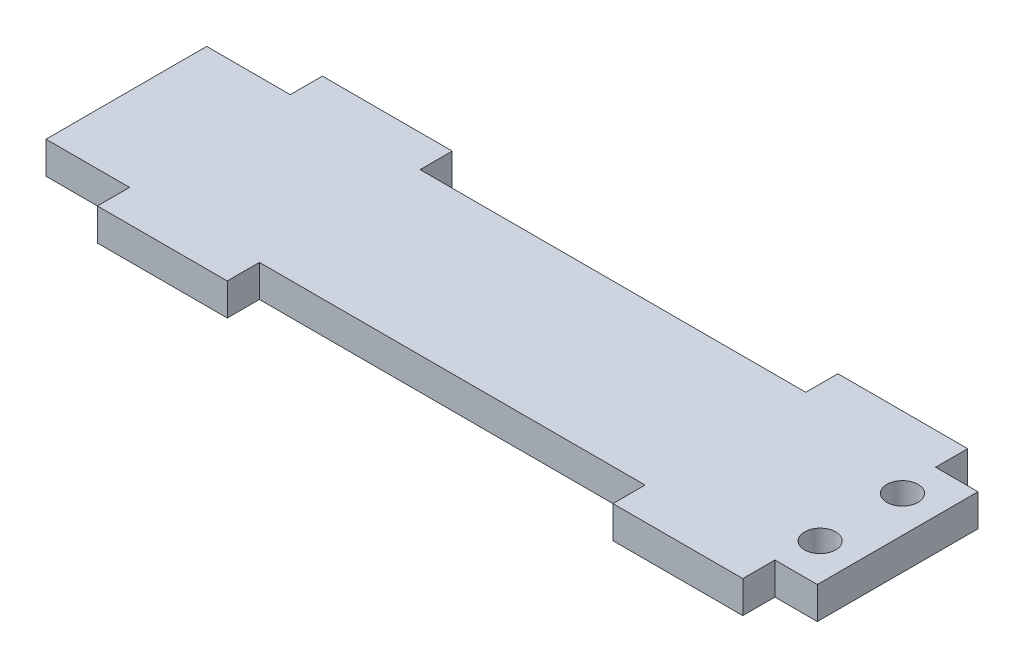
ISO-10303-21;
HEADER;
FILE_DESCRIPTION(('STEP AP214'),'2;1');
FILE_NAME('part.step','',(''),(''),'','','');
FILE_SCHEMA(('AUTOMOTIVE_DESIGN { 1 0 10303 214 1 1 1 1 }'));
ENDSEC;
DATA;
#1=APPLICATION_CONTEXT('core data for automotive mechanical design processes');
#2=APPLICATION_PROTOCOL_DEFINITION('international standard','automotive_design',2000,#1);
#3=PRODUCT_CONTEXT('',#1,'mechanical');
#4=PRODUCT('Part','Part','',(#3));
#5=PRODUCT_RELATED_PRODUCT_CATEGORY('part','',(#4));
#6=PRODUCT_DEFINITION_FORMATION('','',#4);
#7=PRODUCT_DEFINITION_CONTEXT('part definition',#1,'design');
#8=PRODUCT_DEFINITION('design','',#6,#7);
#9=PRODUCT_DEFINITION_SHAPE('','',#8);
#10=(LENGTH_UNIT() NAMED_UNIT(*) SI_UNIT(.MILLI.,.METRE.));
#11=(NAMED_UNIT(*) PLANE_ANGLE_UNIT() SI_UNIT($,.RADIAN.));
#12=(NAMED_UNIT(*) SI_UNIT($,.STERADIAN.) SOLID_ANGLE_UNIT());
#13=UNCERTAINTY_MEASURE_WITH_UNIT(LENGTH_MEASURE(1.E-05),#10,'distance_accuracy_value','');
#14=(GEOMETRIC_REPRESENTATION_CONTEXT(3) GLOBAL_UNCERTAINTY_ASSIGNED_CONTEXT((#13)) GLOBAL_UNIT_ASSIGNED_CONTEXT((#10,
#11,#12)) REPRESENTATION_CONTEXT('',''));
#15=CARTESIAN_POINT('',(0.,0.,0.));
#16=DIRECTION('',(0.,0.,1.));
#17=DIRECTION('',(1.,0.,0.));
#18=AXIS2_PLACEMENT_3D('',#15,#16,#17);
#19=CARTESIAN_POINT('',(0.,6.35,0.));
#20=DIRECTION('',(0.,1.,0.));
#21=DIRECTION('',(0.,0.,1.));
#22=AXIS2_PLACEMENT_3D('',#19,#20,#21);
#23=PLANE('',#22);
#24=CARTESIAN_POINT('',(145.221541211583,6.35,-7.74443567129168));
#25=DIRECTION('',(0.,1.,0.));
#26=DIRECTION('',(0.,0.,1.));
#27=AXIS2_PLACEMENT_3D('',#24,#25,#26);
#28=CIRCLE('',#27,3.08610000000002);
#29=CARTESIAN_POINT('',(145.221541211583,6.35,-4.65833567129167));
#30=VERTEX_POINT('',#29);
#31=EDGE_CURVE('E206',#30,#30,#28,.T.);
#32=ORIENTED_EDGE('',*,*,#31,.F.);
#33=EDGE_LOOP('',(#32));
#34=FACE_BOUND('',#33,.T.);
#35=DIRECTION('',(0.,0.,1.));
#36=VECTOR('',#35,1.);
#37=CARTESIAN_POINT('',(0.,6.35,-31.75));
#38=LINE('',#37,#36);
#39=CARTESIAN_POINT('',(0.,6.35,-31.75));
#40=VERTEX_POINT('',#39);
#41=CARTESIAN_POINT('',(0.,6.35,0.));
#42=VERTEX_POINT('',#41);
#43=EDGE_CURVE('E241',#40,#42,#38,.T.);
#44=ORIENTED_EDGE('',*,*,#43,.T.);
#45=DIRECTION('',(1.,0.,0.));
#46=VECTOR('',#45,1.);
#47=CARTESIAN_POINT('',(0.,6.35,0.));
#48=LINE('',#47,#46);
#49=CARTESIAN_POINT('',(16.51,6.35,0.));
#50=VERTEX_POINT('',#49);
#51=EDGE_CURVE('E129',#42,#50,#48,.T.);
#52=ORIENTED_EDGE('',*,*,#51,.T.);
#53=DIRECTION('',(0.,0.,1.));
#54=VECTOR('',#53,1.);
#55=CARTESIAN_POINT('',(16.51,6.35,0.));
#56=LINE('',#55,#54);
#57=CARTESIAN_POINT('',(16.51,6.35,6.35));
#58=VERTEX_POINT('',#57);
#59=EDGE_CURVE('E292',#50,#58,#56,.T.);
#60=ORIENTED_EDGE('',*,*,#59,.T.);
#61=DIRECTION('',(1.,0.,0.));
#62=VECTOR('',#61,1.);
#63=CARTESIAN_POINT('',(16.51,6.35,6.35));
#64=LINE('',#63,#62);
#65=CARTESIAN_POINT('',(42.164,6.35,6.35));
#66=VERTEX_POINT('',#65);
#67=EDGE_CURVE('E311',#58,#66,#64,.T.);
#68=ORIENTED_EDGE('',*,*,#67,.T.);
#69=DIRECTION('',(0.,0.,-1.));
#70=VECTOR('',#69,1.);
#71=CARTESIAN_POINT('',(42.164,6.35,0.));
#72=LINE('',#71,#70);
#73=CARTESIAN_POINT('',(42.164,6.35,0.));
#74=VERTEX_POINT('',#73);
#75=EDGE_CURVE('E308',#66,#74,#72,.T.);
#76=ORIENTED_EDGE('',*,*,#75,.T.);
#77=DIRECTION('',(1.,0.,0.));
#78=VECTOR('',#77,1.);
#79=CARTESIAN_POINT('',(42.164,6.35,0.));
#80=LINE('',#79,#78);
#81=CARTESIAN_POINT('',(118.364,6.35,0.));
#82=VERTEX_POINT('',#81);
#83=EDGE_CURVE('E310',#74,#82,#80,.T.);
#84=ORIENTED_EDGE('',*,*,#83,.T.);
#85=DIRECTION('',(0.,0.,1.));
#86=VECTOR('',#85,1.);
#87=CARTESIAN_POINT('',(118.364,6.35,0.));
#88=LINE('',#87,#86);
#89=CARTESIAN_POINT('',(118.364,6.35,6.35));
#90=VERTEX_POINT('',#89);
#91=EDGE_CURVE('E313',#82,#90,#88,.T.);
#92=ORIENTED_EDGE('',*,*,#91,.T.);
#93=DIRECTION('',(1.,0.,0.));
#94=VECTOR('',#93,1.);
#95=CARTESIAN_POINT('',(118.364,6.35,6.35));
#96=LINE('',#95,#94);
#97=CARTESIAN_POINT('',(144.018,6.35,6.35));
#98=VERTEX_POINT('',#97);
#99=EDGE_CURVE('E319',#90,#98,#96,.T.);
#100=ORIENTED_EDGE('',*,*,#99,.T.);
#101=DIRECTION('',(0.,0.,-1.));
#102=VECTOR('',#101,1.);
#103=CARTESIAN_POINT('',(144.018,6.35,0.));
#104=LINE('',#103,#102);
#105=CARTESIAN_POINT('',(144.018,6.35,0.));
#106=VERTEX_POINT('',#105);
#107=EDGE_CURVE('E321',#98,#106,#104,.T.);
#108=ORIENTED_EDGE('',*,*,#107,.T.);
#109=DIRECTION('',(1.,0.,0.));
#110=VECTOR('',#109,1.);
#111=CARTESIAN_POINT('',(144.018,6.35,0.));
#112=LINE('',#111,#110);
#113=CARTESIAN_POINT('',(152.4,6.35,0.));
#114=VERTEX_POINT('',#113);
#115=EDGE_CURVE('E323',#106,#114,#112,.T.);
#116=ORIENTED_EDGE('',*,*,#115,.T.);
#117=DIRECTION('',(0.,0.,-1.));
#118=VECTOR('',#117,1.);
#119=CARTESIAN_POINT('',(152.4,6.35,-31.75));
#120=LINE('',#119,#118);
#121=CARTESIAN_POINT('',(152.4,6.35,-31.75));
#122=VERTEX_POINT('',#121);
#123=EDGE_CURVE('E325',#114,#122,#120,.T.);
#124=ORIENTED_EDGE('',*,*,#123,.T.);
#125=DIRECTION('',(-1.,0.,0.));
#126=VECTOR('',#125,1.);
#127=CARTESIAN_POINT('',(144.018,6.35,-31.75));
#128=LINE('',#127,#126);
#129=CARTESIAN_POINT('',(144.018,6.35,-31.75));
#130=VERTEX_POINT('',#129);
#131=EDGE_CURVE('E327',#122,#130,#128,.T.);
#132=ORIENTED_EDGE('',*,*,#131,.T.);
#133=DIRECTION('',(0.,0.,-1.));
#134=VECTOR('',#133,1.);
#135=CARTESIAN_POINT('',(144.018,6.35,-31.75));
#136=LINE('',#135,#134);
#137=CARTESIAN_POINT('',(144.018,6.35,-38.1));
#138=VERTEX_POINT('',#137);
#139=EDGE_CURVE('E329',#130,#138,#136,.T.);
#140=ORIENTED_EDGE('',*,*,#139,.T.);
#141=DIRECTION('',(-1.,0.,0.));
#142=VECTOR('',#141,1.);
#143=CARTESIAN_POINT('',(118.364,6.35,-38.1));
#144=LINE('',#143,#142);
#145=CARTESIAN_POINT('',(118.364,6.35,-38.1));
#146=VERTEX_POINT('',#145);
#147=EDGE_CURVE('E331',#138,#146,#144,.T.);
#148=ORIENTED_EDGE('',*,*,#147,.T.);
#149=DIRECTION('',(0.,0.,1.));
#150=VECTOR('',#149,1.);
#151=CARTESIAN_POINT('',(118.364,6.35,-31.75));
#152=LINE('',#151,#150);
#153=CARTESIAN_POINT('',(118.364,6.35,-31.75));
#154=VERTEX_POINT('',#153);
#155=EDGE_CURVE('E333',#146,#154,#152,.T.);
#156=ORIENTED_EDGE('',*,*,#155,.T.);
#157=DIRECTION('',(-1.,0.,0.));
#158=VECTOR('',#157,1.);
#159=CARTESIAN_POINT('',(42.164,6.35,-31.75));
#160=LINE('',#159,#158);
#161=CARTESIAN_POINT('',(42.164,6.35,-31.75));
#162=VERTEX_POINT('',#161);
#163=EDGE_CURVE('E335',#154,#162,#160,.T.);
#164=ORIENTED_EDGE('',*,*,#163,.T.);
#165=DIRECTION('',(0.,0.,-1.));
#166=VECTOR('',#165,1.);
#167=CARTESIAN_POINT('',(42.164,6.35,-31.75));
#168=LINE('',#167,#166);
#169=CARTESIAN_POINT('',(42.164,6.35,-38.1));
#170=VERTEX_POINT('',#169);
#171=EDGE_CURVE('E184',#162,#170,#168,.T.);
#172=ORIENTED_EDGE('',*,*,#171,.T.);
#173=DIRECTION('',(-1.,0.,0.));
#174=VECTOR('',#173,1.);
#175=CARTESIAN_POINT('',(16.51,6.35,-38.1));
#176=LINE('',#175,#174);
#177=CARTESIAN_POINT('',(16.51,6.35,-38.1));
#178=VERTEX_POINT('',#177);
#179=EDGE_CURVE('E178',#170,#178,#176,.T.);
#180=ORIENTED_EDGE('',*,*,#179,.T.);
#181=DIRECTION('',(0.,0.,1.));
#182=VECTOR('',#181,1.);
#183=CARTESIAN_POINT('',(16.51,6.35,-31.75));
#184=LINE('',#183,#182);
#185=CARTESIAN_POINT('',(16.51,6.35,-31.75));
#186=VERTEX_POINT('',#185);
#187=EDGE_CURVE('E182',#178,#186,#184,.T.);
#188=ORIENTED_EDGE('',*,*,#187,.T.);
#189=DIRECTION('',(-1.,0.,0.));
#190=VECTOR('',#189,1.);
#191=CARTESIAN_POINT('',(0.,6.35,-31.75));
#192=LINE('',#191,#190);
#193=EDGE_CURVE('E50',#186,#40,#192,.T.);
#194=ORIENTED_EDGE('',*,*,#193,.T.);
#195=EDGE_LOOP('',(#44,#52,#60,#68,#76,#84,#92,#100,#108,#116,#124,#132,#140,#148,#156,#164,
#172,#180,#188,#194));
#196=FACE_BOUND('',#195,.T.);
#197=CARTESIAN_POINT('',(145.221541211583,6.35,-24.0055643287083));
#198=DIRECTION('',(0.,1.,0.));
#199=DIRECTION('',(0.,0.,-1.));
#200=AXIS2_PLACEMENT_3D('',#197,#198,#199);
#201=CIRCLE('',#200,3.08610000000002);
#202=CARTESIAN_POINT('',(145.221541211583,6.35,-27.0916643287083));
#203=VERTEX_POINT('',#202);
#204=EDGE_CURVE('E377',#203,#203,#201,.T.);
#205=ORIENTED_EDGE('',*,*,#204,.F.);
#206=EDGE_LOOP('',(#205));
#207=FACE_BOUND('',#206,.T.);
#208=ADVANCED_FACE('F33',(#34,#196,#207),#23,.T.);
#209=CARTESIAN_POINT('',(0.,0.,0.));
#210=DIRECTION('',(0.,1.,0.));
#211=DIRECTION('',(0.,0.,1.));
#212=AXIS2_PLACEMENT_3D('',#209,#210,#211);
#213=PLANE('',#212);
#214=DIRECTION('',(0.,0.,1.));
#215=VECTOR('',#214,1.);
#216=CARTESIAN_POINT('',(0.,0.,-31.75));
#217=LINE('',#216,#215);
#218=CARTESIAN_POINT('',(0.,0.,-31.75));
#219=VERTEX_POINT('',#218);
#220=CARTESIAN_POINT('',(0.,0.,0.));
#221=VERTEX_POINT('',#220);
#222=EDGE_CURVE('E202',#219,#221,#217,.T.);
#223=ORIENTED_EDGE('',*,*,#222,.F.);
#224=DIRECTION('',(-1.,0.,0.));
#225=VECTOR('',#224,1.);
#226=CARTESIAN_POINT('',(0.,0.,-31.75));
#227=LINE('',#226,#225);
#228=CARTESIAN_POINT('',(16.51,0.,-31.75));
#229=VERTEX_POINT('',#228);
#230=EDGE_CURVE('E121',#229,#219,#227,.T.);
#231=ORIENTED_EDGE('',*,*,#230,.F.);
#232=DIRECTION('',(0.,0.,1.));
#233=VECTOR('',#232,1.);
#234=CARTESIAN_POINT('',(16.51,0.,-31.75));
#235=LINE('',#234,#233);
#236=CARTESIAN_POINT('',(16.51,0.,-38.1));
#237=VERTEX_POINT('',#236);
#238=EDGE_CURVE('E115',#237,#229,#235,.T.);
#239=ORIENTED_EDGE('',*,*,#238,.F.);
#240=DIRECTION('',(-1.,0.,0.));
#241=VECTOR('',#240,1.);
#242=CARTESIAN_POINT('',(16.51,0.,-38.1));
#243=LINE('',#242,#241);
#244=CARTESIAN_POINT('',(42.164,0.,-38.1));
#245=VERTEX_POINT('',#244);
#246=EDGE_CURVE('E192',#245,#237,#243,.T.);
#247=ORIENTED_EDGE('',*,*,#246,.F.);
#248=DIRECTION('',(0.,0.,-1.));
#249=VECTOR('',#248,1.);
#250=CARTESIAN_POINT('',(42.164,0.,-31.75));
#251=LINE('',#250,#249);
#252=CARTESIAN_POINT('',(42.164,0.,-31.75));
#253=VERTEX_POINT('',#252);
#254=EDGE_CURVE('E236',#253,#245,#251,.T.);
#255=ORIENTED_EDGE('',*,*,#254,.F.);
#256=DIRECTION('',(-1.,0.,0.));
#257=VECTOR('',#256,1.);
#258=CARTESIAN_POINT('',(42.164,0.,-31.75));
#259=LINE('',#258,#257);
#260=CARTESIAN_POINT('',(118.364,0.,-31.75));
#261=VERTEX_POINT('',#260);
#262=EDGE_CURVE('E234',#261,#253,#259,.T.);
#263=ORIENTED_EDGE('',*,*,#262,.F.);
#264=DIRECTION('',(0.,0.,1.));
#265=VECTOR('',#264,1.);
#266=CARTESIAN_POINT('',(118.364,0.,-31.75));
#267=LINE('',#266,#265);
#268=CARTESIAN_POINT('',(118.364,0.,-38.1));
#269=VERTEX_POINT('',#268);
#270=EDGE_CURVE('E232',#269,#261,#267,.T.);
#271=ORIENTED_EDGE('',*,*,#270,.F.);
#272=DIRECTION('',(-1.,0.,0.));
#273=VECTOR('',#272,1.);
#274=CARTESIAN_POINT('',(118.364,0.,-38.1));
#275=LINE('',#274,#273);
#276=CARTESIAN_POINT('',(144.018,0.,-38.1));
#277=VERTEX_POINT('',#276);
#278=EDGE_CURVE('E230',#277,#269,#275,.T.);
#279=ORIENTED_EDGE('',*,*,#278,.F.);
#280=DIRECTION('',(0.,0.,-1.));
#281=VECTOR('',#280,1.);
#282=CARTESIAN_POINT('',(144.018,0.,-31.75));
#283=LINE('',#282,#281);
#284=CARTESIAN_POINT('',(144.018,0.,-31.75));
#285=VERTEX_POINT('',#284);
#286=EDGE_CURVE('E228',#285,#277,#283,.T.);
#287=ORIENTED_EDGE('',*,*,#286,.F.);
#288=DIRECTION('',(-1.,0.,0.));
#289=VECTOR('',#288,1.);
#290=CARTESIAN_POINT('',(144.018,0.,-31.75));
#291=LINE('',#290,#289);
#292=CARTESIAN_POINT('',(152.4,0.,-31.75));
#293=VERTEX_POINT('',#292);
#294=EDGE_CURVE('E226',#293,#285,#291,.T.);
#295=ORIENTED_EDGE('',*,*,#294,.F.);
#296=DIRECTION('',(0.,0.,-1.));
#297=VECTOR('',#296,1.);
#298=CARTESIAN_POINT('',(152.4,0.,-31.75));
#299=LINE('',#298,#297);
#300=CARTESIAN_POINT('',(152.4,0.,0.));
#301=VERTEX_POINT('',#300);
#302=EDGE_CURVE('E224',#301,#293,#299,.T.);
#303=ORIENTED_EDGE('',*,*,#302,.F.);
#304=DIRECTION('',(1.,0.,0.));
#305=VECTOR('',#304,1.);
#306=CARTESIAN_POINT('',(144.018,0.,0.));
#307=LINE('',#306,#305);
#308=CARTESIAN_POINT('',(144.018,0.,0.));
#309=VERTEX_POINT('',#308);
#310=EDGE_CURVE('E222',#309,#301,#307,.T.);
#311=ORIENTED_EDGE('',*,*,#310,.F.);
#312=DIRECTION('',(0.,0.,-1.));
#313=VECTOR('',#312,1.);
#314=CARTESIAN_POINT('',(144.018,0.,0.));
#315=LINE('',#314,#313);
#316=CARTESIAN_POINT('',(144.018,0.,6.35));
#317=VERTEX_POINT('',#316);
#318=EDGE_CURVE('E220',#317,#309,#315,.T.);
#319=ORIENTED_EDGE('',*,*,#318,.F.);
#320=DIRECTION('',(1.,0.,0.));
#321=VECTOR('',#320,1.);
#322=CARTESIAN_POINT('',(118.364,0.,6.35));
#323=LINE('',#322,#321);
#324=CARTESIAN_POINT('',(118.364,0.,6.35));
#325=VERTEX_POINT('',#324);
#326=EDGE_CURVE('E218',#325,#317,#323,.T.);
#327=ORIENTED_EDGE('',*,*,#326,.F.);
#328=DIRECTION('',(0.,0.,1.));
#329=VECTOR('',#328,1.);
#330=CARTESIAN_POINT('',(118.364,0.,0.));
#331=LINE('',#330,#329);
#332=CARTESIAN_POINT('',(118.364,0.,0.));
#333=VERTEX_POINT('',#332);
#334=EDGE_CURVE('E216',#333,#325,#331,.T.);
#335=ORIENTED_EDGE('',*,*,#334,.F.);
#336=DIRECTION('',(1.,0.,0.));
#337=VECTOR('',#336,1.);
#338=CARTESIAN_POINT('',(42.164,0.,0.));
#339=LINE('',#338,#337);
#340=CARTESIAN_POINT('',(42.164,0.,0.));
#341=VERTEX_POINT('',#340);
#342=EDGE_CURVE('E214',#341,#333,#339,.T.);
#343=ORIENTED_EDGE('',*,*,#342,.F.);
#344=DIRECTION('',(0.,0.,-1.));
#345=VECTOR('',#344,1.);
#346=CARTESIAN_POINT('',(42.164,0.,0.));
#347=LINE('',#346,#345);
#348=CARTESIAN_POINT('',(42.164,0.,6.35));
#349=VERTEX_POINT('',#348);
#350=EDGE_CURVE('E212',#349,#341,#347,.T.);
#351=ORIENTED_EDGE('',*,*,#350,.F.);
#352=DIRECTION('',(1.,0.,0.));
#353=VECTOR('',#352,1.);
#354=CARTESIAN_POINT('',(16.51,0.,6.35));
#355=LINE('',#354,#353);
#356=CARTESIAN_POINT('',(16.51,0.,6.35));
#357=VERTEX_POINT('',#356);
#358=EDGE_CURVE('E210',#357,#349,#355,.T.);
#359=ORIENTED_EDGE('',*,*,#358,.F.);
#360=DIRECTION('',(0.,0.,1.));
#361=VECTOR('',#360,1.);
#362=CARTESIAN_POINT('',(16.51,0.,0.));
#363=LINE('',#362,#361);
#364=CARTESIAN_POINT('',(16.51,0.,0.));
#365=VERTEX_POINT('',#364);
#366=EDGE_CURVE('E208',#365,#357,#363,.T.);
#367=ORIENTED_EDGE('',*,*,#366,.F.);
#368=DIRECTION('',(1.,0.,0.));
#369=VECTOR('',#368,1.);
#370=CARTESIAN_POINT('',(0.,0.,0.));
#371=LINE('',#370,#369);
#372=EDGE_CURVE('E205',#221,#365,#371,.T.);
#373=ORIENTED_EDGE('',*,*,#372,.F.);
#374=EDGE_LOOP('',(#223,#231,#239,#247,#255,#263,#271,#279,#287,#295,#303,#311,#319,#327,#335,
#343,#351,#359,#367,#373));
#375=FACE_BOUND('',#374,.T.);
#376=CARTESIAN_POINT('',(145.221541211583,0.,-7.74443567129168));
#377=DIRECTION('',(0.,1.,0.));
#378=DIRECTION('',(0.,0.,1.));
#379=AXIS2_PLACEMENT_3D('',#376,#377,#378);
#380=CIRCLE('',#379,3.08610000000002);
#381=CARTESIAN_POINT('',(145.221541211583,0.,-4.65833567129167));
#382=VERTEX_POINT('',#381);
#383=EDGE_CURVE('E383',#382,#382,#380,.T.);
#384=ORIENTED_EDGE('',*,*,#383,.T.);
#385=EDGE_LOOP('',(#384));
#386=FACE_BOUND('',#385,.T.);
#387=CARTESIAN_POINT('',(145.221541211583,0.,-24.0055643287083));
#388=DIRECTION('',(0.,1.,0.));
#389=DIRECTION('',(0.,0.,-1.));
#390=AXIS2_PLACEMENT_3D('',#387,#388,#389);
#391=CIRCLE('',#390,3.08610000000002);
#392=CARTESIAN_POINT('',(145.221541211583,0.,-27.0916643287083));
#393=VERTEX_POINT('',#392);
#394=EDGE_CURVE('E380',#393,#393,#391,.T.);
#395=ORIENTED_EDGE('',*,*,#394,.T.);
#396=EDGE_LOOP('',(#395));
#397=FACE_BOUND('',#396,.T.);
#398=ADVANCED_FACE('F296',(#375,#386,#397),#213,.F.);
#399=CARTESIAN_POINT('',(0.,6.35,-31.75));
#400=DIRECTION('',(1.,0.,0.));
#401=DIRECTION('',(0.,0.,-1.));
#402=AXIS2_PLACEMENT_3D('',#399,#400,#401);
#403=PLANE('',#402);
#404=ORIENTED_EDGE('',*,*,#222,.T.);
#405=DIRECTION('',(0.,-1.,0.));
#406=VECTOR('',#405,1.);
#407=CARTESIAN_POINT('',(0.,6.35,0.));
#408=LINE('',#407,#406);
#409=EDGE_CURVE('E11',#42,#221,#408,.T.);
#410=ORIENTED_EDGE('',*,*,#409,.F.);
#411=ORIENTED_EDGE('',*,*,#43,.F.);
#412=DIRECTION('',(0.,-1.,0.));
#413=VECTOR('',#412,1.);
#414=CARTESIAN_POINT('',(0.,6.35,-31.75));
#415=LINE('',#414,#413);
#416=EDGE_CURVE('E198',#40,#219,#415,.T.);
#417=ORIENTED_EDGE('',*,*,#416,.T.);
#418=EDGE_LOOP('',(#404,#410,#411,#417));
#419=FACE_BOUND('',#418,.T.);
#420=ADVANCED_FACE('F35',(#419),#403,.F.);
#421=CARTESIAN_POINT('',(0.,6.35,0.));
#422=DIRECTION('',(0.,0.,-1.));
#423=DIRECTION('',(-1.,0.,0.));
#424=AXIS2_PLACEMENT_3D('',#421,#422,#423);
#425=PLANE('',#424);
#426=ORIENTED_EDGE('',*,*,#372,.T.);
#427=DIRECTION('',(0.,-1.,0.));
#428=VECTOR('',#427,1.);
#429=CARTESIAN_POINT('',(16.51,6.35,0.));
#430=LINE('',#429,#428);
#431=EDGE_CURVE('E42',#50,#365,#430,.T.);
#432=ORIENTED_EDGE('',*,*,#431,.F.);
#433=ORIENTED_EDGE('',*,*,#51,.F.);
#434=ORIENTED_EDGE('',*,*,#409,.T.);
#435=EDGE_LOOP('',(#426,#432,#433,#434));
#436=FACE_BOUND('',#435,.T.);
#437=ADVANCED_FACE('F556',(#436),#425,.F.);
#438=CARTESIAN_POINT('',(16.51,6.35,0.));
#439=DIRECTION('',(1.,0.,0.));
#440=DIRECTION('',(0.,0.,-1.));
#441=AXIS2_PLACEMENT_3D('',#438,#439,#440);
#442=PLANE('',#441);
#443=ORIENTED_EDGE('',*,*,#366,.T.);
#444=DIRECTION('',(0.,-1.,0.));
#445=VECTOR('',#444,1.);
#446=CARTESIAN_POINT('',(16.51,6.35,6.35));
#447=LINE('',#446,#445);
#448=EDGE_CURVE('E284',#58,#357,#447,.T.);
#449=ORIENTED_EDGE('',*,*,#448,.F.);
#450=ORIENTED_EDGE('',*,*,#59,.F.);
#451=ORIENTED_EDGE('',*,*,#431,.T.);
#452=EDGE_LOOP('',(#443,#449,#450,#451));
#453=FACE_BOUND('',#452,.T.);
#454=ADVANCED_FACE('F290',(#453),#442,.F.);
#455=CARTESIAN_POINT('',(16.51,6.35,6.35));
#456=DIRECTION('',(0.,0.,-1.));
#457=DIRECTION('',(-1.,0.,0.));
#458=AXIS2_PLACEMENT_3D('',#455,#456,#457);
#459=PLANE('',#458);
#460=ORIENTED_EDGE('',*,*,#358,.T.);
#461=DIRECTION('',(0.,-1.,0.));
#462=VECTOR('',#461,1.);
#463=CARTESIAN_POINT('',(42.164,6.35,6.35));
#464=LINE('',#463,#462);
#465=EDGE_CURVE('E281',#66,#349,#464,.T.);
#466=ORIENTED_EDGE('',*,*,#465,.F.);
#467=ORIENTED_EDGE('',*,*,#67,.F.);
#468=ORIENTED_EDGE('',*,*,#448,.T.);
#469=EDGE_LOOP('',(#460,#466,#467,#468));
#470=FACE_BOUND('',#469,.T.);
#471=ADVANCED_FACE('F302',(#470),#459,.F.);
#472=CARTESIAN_POINT('',(42.164,6.35,0.));
#473=DIRECTION('',(-1.,0.,0.));
#474=DIRECTION('',(0.,0.,1.));
#475=AXIS2_PLACEMENT_3D('',#472,#473,#474);
#476=PLANE('',#475);
#477=ORIENTED_EDGE('',*,*,#350,.T.);
#478=DIRECTION('',(0.,-1.,0.));
#479=VECTOR('',#478,1.);
#480=CARTESIAN_POINT('',(42.164,6.35,0.));
#481=LINE('',#480,#479);
#482=EDGE_CURVE('E278',#74,#341,#481,.T.);
#483=ORIENTED_EDGE('',*,*,#482,.F.);
#484=ORIENTED_EDGE('',*,*,#75,.F.);
#485=ORIENTED_EDGE('',*,*,#465,.T.);
#486=EDGE_LOOP('',(#477,#483,#484,#485));
#487=FACE_BOUND('',#486,.T.);
#488=ADVANCED_FACE('F306',(#487),#476,.F.);
#489=CARTESIAN_POINT('',(42.164,6.35,0.));
#490=DIRECTION('',(0.,0.,-1.));
#491=DIRECTION('',(-1.,0.,0.));
#492=AXIS2_PLACEMENT_3D('',#489,#490,#491);
#493=PLANE('',#492);
#494=ORIENTED_EDGE('',*,*,#342,.T.);
#495=DIRECTION('',(0.,-1.,0.));
#496=VECTOR('',#495,1.);
#497=CARTESIAN_POINT('',(118.364,6.35,0.));
#498=LINE('',#497,#496);
#499=EDGE_CURVE('E275',#82,#333,#498,.T.);
#500=ORIENTED_EDGE('',*,*,#499,.F.);
#501=ORIENTED_EDGE('',*,*,#83,.F.);
#502=ORIENTED_EDGE('',*,*,#482,.T.);
#503=EDGE_LOOP('',(#494,#500,#501,#502));
#504=FACE_BOUND('',#503,.T.);
#505=ADVANCED_FACE('F521',(#504),#493,.F.);
#506=CARTESIAN_POINT('',(118.364,6.35,0.));
#507=DIRECTION('',(1.,0.,0.));
#508=DIRECTION('',(0.,0.,-1.));
#509=AXIS2_PLACEMENT_3D('',#506,#507,#508);
#510=PLANE('',#509);
#511=ORIENTED_EDGE('',*,*,#334,.T.);
#512=DIRECTION('',(0.,-1.,0.));
#513=VECTOR('',#512,1.);
#514=CARTESIAN_POINT('',(118.364,6.35,6.35));
#515=LINE('',#514,#513);
#516=EDGE_CURVE('E272',#90,#325,#515,.T.);
#517=ORIENTED_EDGE('',*,*,#516,.F.);
#518=ORIENTED_EDGE('',*,*,#91,.F.);
#519=ORIENTED_EDGE('',*,*,#499,.T.);
#520=EDGE_LOOP('',(#511,#517,#518,#519));
#521=FACE_BOUND('',#520,.T.);
#522=ADVANCED_FACE('F511',(#521),#510,.F.);
#523=CARTESIAN_POINT('',(118.364,6.35,6.35));
#524=DIRECTION('',(0.,0.,-1.));
#525=DIRECTION('',(-1.,0.,0.));
#526=AXIS2_PLACEMENT_3D('',#523,#524,#525);
#527=PLANE('',#526);
#528=ORIENTED_EDGE('',*,*,#326,.T.);
#529=DIRECTION('',(0.,-1.,0.));
#530=VECTOR('',#529,1.);
#531=CARTESIAN_POINT('',(144.018,6.35,6.35));
#532=LINE('',#531,#530);
#533=EDGE_CURVE('E269',#98,#317,#532,.T.);
#534=ORIENTED_EDGE('',*,*,#533,.F.);
#535=ORIENTED_EDGE('',*,*,#99,.F.);
#536=ORIENTED_EDGE('',*,*,#516,.T.);
#537=EDGE_LOOP('',(#528,#534,#535,#536));
#538=FACE_BOUND('',#537,.T.);
#539=ADVANCED_FACE('F501',(#538),#527,.F.);
#540=CARTESIAN_POINT('',(144.018,6.35,0.));
#541=DIRECTION('',(-1.,0.,0.));
#542=DIRECTION('',(0.,0.,1.));
#543=AXIS2_PLACEMENT_3D('',#540,#541,#542);
#544=PLANE('',#543);
#545=ORIENTED_EDGE('',*,*,#318,.T.);
#546=DIRECTION('',(0.,-1.,0.));
#547=VECTOR('',#546,1.);
#548=CARTESIAN_POINT('',(144.018,6.35,0.));
#549=LINE('',#548,#547);
#550=EDGE_CURVE('E266',#106,#309,#549,.T.);
#551=ORIENTED_EDGE('',*,*,#550,.F.);
#552=ORIENTED_EDGE('',*,*,#107,.F.);
#553=ORIENTED_EDGE('',*,*,#533,.T.);
#554=EDGE_LOOP('',(#545,#551,#552,#553));
#555=FACE_BOUND('',#554,.T.);
#556=ADVANCED_FACE('F491',(#555),#544,.F.);
#557=CARTESIAN_POINT('',(144.018,6.35,0.));
#558=DIRECTION('',(0.,0.,-1.));
#559=DIRECTION('',(-1.,0.,0.));
#560=AXIS2_PLACEMENT_3D('',#557,#558,#559);
#561=PLANE('',#560);
#562=ORIENTED_EDGE('',*,*,#310,.T.);
#563=DIRECTION('',(0.,-1.,0.));
#564=VECTOR('',#563,1.);
#565=CARTESIAN_POINT('',(152.4,6.35,0.));
#566=LINE('',#565,#564);
#567=EDGE_CURVE('E263',#114,#301,#566,.T.);
#568=ORIENTED_EDGE('',*,*,#567,.F.);
#569=ORIENTED_EDGE('',*,*,#115,.F.);
#570=ORIENTED_EDGE('',*,*,#550,.T.);
#571=EDGE_LOOP('',(#562,#568,#569,#570));
#572=FACE_BOUND('',#571,.T.);
#573=ADVANCED_FACE('F481',(#572),#561,.F.);
#574=CARTESIAN_POINT('',(152.4,6.35,-31.75));
#575=DIRECTION('',(-1.,0.,0.));
#576=DIRECTION('',(0.,0.,1.));
#577=AXIS2_PLACEMENT_3D('',#574,#575,#576);
#578=PLANE('',#577);
#579=ORIENTED_EDGE('',*,*,#302,.T.);
#580=DIRECTION('',(0.,-1.,0.));
#581=VECTOR('',#580,1.);
#582=CARTESIAN_POINT('',(152.4,6.35,-31.75));
#583=LINE('',#582,#581);
#584=EDGE_CURVE('E260',#122,#293,#583,.T.);
#585=ORIENTED_EDGE('',*,*,#584,.F.);
#586=ORIENTED_EDGE('',*,*,#123,.F.);
#587=ORIENTED_EDGE('',*,*,#567,.T.);
#588=EDGE_LOOP('',(#579,#585,#586,#587));
#589=FACE_BOUND('',#588,.T.);
#590=ADVANCED_FACE('F471',(#589),#578,.F.);
#591=CARTESIAN_POINT('',(144.018,6.35,-31.75));
#592=DIRECTION('',(0.,0.,1.));
#593=DIRECTION('',(1.,0.,0.));
#594=AXIS2_PLACEMENT_3D('',#591,#592,#593);
#595=PLANE('',#594);
#596=ORIENTED_EDGE('',*,*,#294,.T.);
#597=DIRECTION('',(0.,-1.,0.));
#598=VECTOR('',#597,1.);
#599=CARTESIAN_POINT('',(144.018,6.35,-31.75));
#600=LINE('',#599,#598);
#601=EDGE_CURVE('E257',#130,#285,#600,.T.);
#602=ORIENTED_EDGE('',*,*,#601,.F.);
#603=ORIENTED_EDGE('',*,*,#131,.F.);
#604=ORIENTED_EDGE('',*,*,#584,.T.);
#605=EDGE_LOOP('',(#596,#602,#603,#604));
#606=FACE_BOUND('',#605,.T.);
#607=ADVANCED_FACE('F461',(#606),#595,.F.);
#608=CARTESIAN_POINT('',(144.018,6.35,-31.75));
#609=DIRECTION('',(-1.,0.,0.));
#610=DIRECTION('',(0.,0.,1.));
#611=AXIS2_PLACEMENT_3D('',#608,#609,#610);
#612=PLANE('',#611);
#613=ORIENTED_EDGE('',*,*,#286,.T.);
#614=DIRECTION('',(0.,-1.,0.));
#615=VECTOR('',#614,1.);
#616=CARTESIAN_POINT('',(144.018,6.35,-38.1));
#617=LINE('',#616,#615);
#618=EDGE_CURVE('E254',#138,#277,#617,.T.);
#619=ORIENTED_EDGE('',*,*,#618,.F.);
#620=ORIENTED_EDGE('',*,*,#139,.F.);
#621=ORIENTED_EDGE('',*,*,#601,.T.);
#622=EDGE_LOOP('',(#613,#619,#620,#621));
#623=FACE_BOUND('',#622,.T.);
#624=ADVANCED_FACE('F451',(#623),#612,.F.);
#625=CARTESIAN_POINT('',(118.364,6.35,-38.1));
#626=DIRECTION('',(0.,0.,1.));
#627=DIRECTION('',(1.,0.,0.));
#628=AXIS2_PLACEMENT_3D('',#625,#626,#627);
#629=PLANE('',#628);
#630=ORIENTED_EDGE('',*,*,#278,.T.);
#631=DIRECTION('',(0.,-1.,0.));
#632=VECTOR('',#631,1.);
#633=CARTESIAN_POINT('',(118.364,6.35,-38.1));
#634=LINE('',#633,#632);
#635=EDGE_CURVE('E251',#146,#269,#634,.T.);
#636=ORIENTED_EDGE('',*,*,#635,.F.);
#637=ORIENTED_EDGE('',*,*,#147,.F.);
#638=ORIENTED_EDGE('',*,*,#618,.T.);
#639=EDGE_LOOP('',(#630,#636,#637,#638));
#640=FACE_BOUND('',#639,.T.);
#641=ADVANCED_FACE('F441',(#640),#629,.F.);
#642=CARTESIAN_POINT('',(118.364,6.35,-31.75));
#643=DIRECTION('',(1.,0.,0.));
#644=DIRECTION('',(0.,0.,-1.));
#645=AXIS2_PLACEMENT_3D('',#642,#643,#644);
#646=PLANE('',#645);
#647=ORIENTED_EDGE('',*,*,#270,.T.);
#648=DIRECTION('',(0.,-1.,0.));
#649=VECTOR('',#648,1.);
#650=CARTESIAN_POINT('',(118.364,6.35,-31.75));
#651=LINE('',#650,#649);
#652=EDGE_CURVE('E248',#154,#261,#651,.T.);
#653=ORIENTED_EDGE('',*,*,#652,.F.);
#654=ORIENTED_EDGE('',*,*,#155,.F.);
#655=ORIENTED_EDGE('',*,*,#635,.T.);
#656=EDGE_LOOP('',(#647,#653,#654,#655));
#657=FACE_BOUND('',#656,.T.);
#658=ADVANCED_FACE('F432',(#657),#646,.F.);
#659=CARTESIAN_POINT('',(42.164,6.35,-31.75));
#660=DIRECTION('',(0.,0.,1.));
#661=DIRECTION('',(1.,0.,0.));
#662=AXIS2_PLACEMENT_3D('',#659,#660,#661);
#663=PLANE('',#662);
#664=ORIENTED_EDGE('',*,*,#262,.T.);
#665=DIRECTION('',(0.,-1.,0.));
#666=VECTOR('',#665,1.);
#667=CARTESIAN_POINT('',(42.164,6.35,-31.75));
#668=LINE('',#667,#666);
#669=EDGE_CURVE('E245',#162,#253,#668,.T.);
#670=ORIENTED_EDGE('',*,*,#669,.F.);
#671=ORIENTED_EDGE('',*,*,#163,.F.);
#672=ORIENTED_EDGE('',*,*,#652,.T.);
#673=EDGE_LOOP('',(#664,#670,#671,#672));
#674=FACE_BOUND('',#673,.T.);
#675=ADVANCED_FACE('F341',(#674),#663,.F.);
#676=CARTESIAN_POINT('',(42.164,6.35,-31.75));
#677=DIRECTION('',(-1.,0.,0.));
#678=DIRECTION('',(0.,0.,1.));
#679=AXIS2_PLACEMENT_3D('',#676,#677,#678);
#680=PLANE('',#679);
#681=ORIENTED_EDGE('',*,*,#254,.T.);
#682=DIRECTION('',(0.,-1.,0.));
#683=VECTOR('',#682,1.);
#684=CARTESIAN_POINT('',(42.164,6.35,-38.1));
#685=LINE('',#684,#683);
#686=EDGE_CURVE('E193',#170,#245,#685,.T.);
#687=ORIENTED_EDGE('',*,*,#686,.F.);
#688=ORIENTED_EDGE('',*,*,#171,.F.);
#689=ORIENTED_EDGE('',*,*,#669,.T.);
#690=EDGE_LOOP('',(#681,#687,#688,#689));
#691=FACE_BOUND('',#690,.T.);
#692=ADVANCED_FACE('F345',(#691),#680,.F.);
#693=CARTESIAN_POINT('',(16.51,6.35,-38.1));
#694=DIRECTION('',(0.,0.,1.));
#695=DIRECTION('',(1.,0.,0.));
#696=AXIS2_PLACEMENT_3D('',#693,#694,#695);
#697=PLANE('',#696);
#698=ORIENTED_EDGE('',*,*,#246,.T.);
#699=DIRECTION('',(0.,-1.,0.));
#700=VECTOR('',#699,1.);
#701=CARTESIAN_POINT('',(16.51,6.35,-38.1));
#702=LINE('',#701,#700);
#703=EDGE_CURVE('E189',#178,#237,#702,.T.);
#704=ORIENTED_EDGE('',*,*,#703,.F.);
#705=ORIENTED_EDGE('',*,*,#179,.F.);
#706=ORIENTED_EDGE('',*,*,#686,.T.);
#707=EDGE_LOOP('',(#698,#704,#705,#706));
#708=FACE_BOUND('',#707,.T.);
#709=ADVANCED_FACE('F190',(#708),#697,.F.);
#710=CARTESIAN_POINT('',(16.51,6.35,-31.75));
#711=DIRECTION('',(1.,0.,0.));
#712=DIRECTION('',(0.,0.,-1.));
#713=AXIS2_PLACEMENT_3D('',#710,#711,#712);
#714=PLANE('',#713);
#715=ORIENTED_EDGE('',*,*,#238,.T.);
#716=DIRECTION('',(0.,-1.,0.));
#717=VECTOR('',#716,1.);
#718=CARTESIAN_POINT('',(16.51,6.35,-31.75));
#719=LINE('',#718,#717);
#720=EDGE_CURVE('E194',#186,#229,#719,.T.);
#721=ORIENTED_EDGE('',*,*,#720,.F.);
#722=ORIENTED_EDGE('',*,*,#187,.F.);
#723=ORIENTED_EDGE('',*,*,#703,.T.);
#724=EDGE_LOOP('',(#715,#721,#722,#723));
#725=FACE_BOUND('',#724,.T.);
#726=ADVANCED_FACE('F196',(#725),#714,.F.);
#727=CARTESIAN_POINT('',(0.,6.35,-31.75));
#728=DIRECTION('',(0.,0.,1.));
#729=DIRECTION('',(1.,0.,0.));
#730=AXIS2_PLACEMENT_3D('',#727,#728,#729);
#731=PLANE('',#730);
#732=ORIENTED_EDGE('',*,*,#230,.T.);
#733=ORIENTED_EDGE('',*,*,#416,.F.);
#734=ORIENTED_EDGE('',*,*,#193,.F.);
#735=ORIENTED_EDGE('',*,*,#720,.T.);
#736=EDGE_LOOP('',(#732,#733,#734,#735));
#737=FACE_BOUND('',#736,.T.);
#738=ADVANCED_FACE('F349',(#737),#731,.F.);
#739=CARTESIAN_POINT('',(145.221541211583,6.35,-7.74443567129168));
#740=DIRECTION('',(0.,-1.,0.));
#741=DIRECTION('',(0.,0.,-1.));
#742=AXIS2_PLACEMENT_3D('',#739,#740,#741);
#743=CYLINDRICAL_SURFACE('',#742,3.08610000000002);
#744=ORIENTED_EDGE('',*,*,#31,.T.);
#745=EDGE_LOOP('',(#744));
#746=FACE_BOUND('',#745,.T.);
#747=ORIENTED_EDGE('',*,*,#383,.F.);
#748=EDGE_LOOP('',(#747));
#749=FACE_BOUND('',#748,.T.);
#750=ADVANCED_FACE('F351',(#746,#749),#743,.F.);
#751=CARTESIAN_POINT('',(145.221541211583,6.35,-24.0055643287083));
#752=DIRECTION('',(0.,-1.,0.));
#753=DIRECTION('',(0.,0.,-1.));
#754=AXIS2_PLACEMENT_3D('',#751,#752,#753);
#755=CYLINDRICAL_SURFACE('',#754,3.08610000000002);
#756=ORIENTED_EDGE('',*,*,#204,.T.);
#757=EDGE_LOOP('',(#756));
#758=FACE_BOUND('',#757,.T.);
#759=ORIENTED_EDGE('',*,*,#394,.F.);
#760=EDGE_LOOP('',(#759));
#761=FACE_BOUND('',#760,.T.);
#762=ADVANCED_FACE('F357',(#758,#761),#755,.F.);
#763=CLOSED_SHELL('',(#208,#398,#420,#437,#454,#471,#488,#505,#522,#539,#556,#573,#590,#607,
#624,#641,#658,#675,#692,#709,#726,#738,#750,#762));
#764=MANIFOLD_SOLID_BREP('B2',#763);
#765=ADVANCED_BREP_SHAPE_REPRESENTATION('',(#18,#764),#14);
#766=SHAPE_DEFINITION_REPRESENTATION(#9,#765);
ENDSEC;
END-ISO-10303-21;
